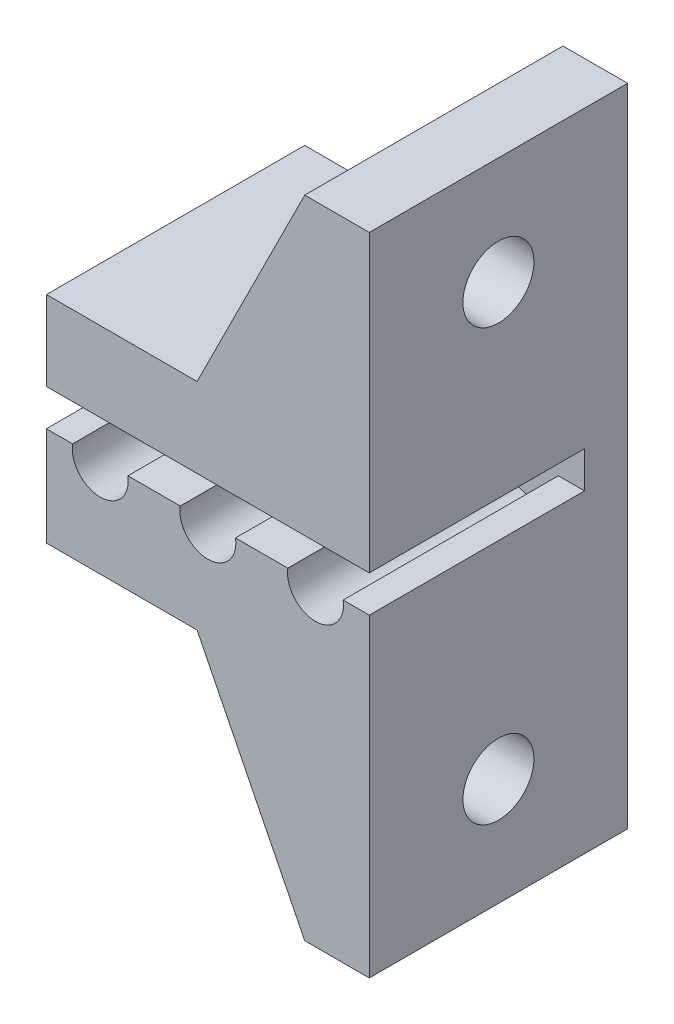
ISO-10303-21;
HEADER;
FILE_DESCRIPTION(('STEP AP214'),'2;1');
FILE_NAME('part.step','',(''),(''),'','','');
FILE_SCHEMA(('AUTOMOTIVE_DESIGN { 1 0 10303 214 1 1 1 1 }'));
ENDSEC;
DATA;
#1=APPLICATION_CONTEXT('core data for automotive mechanical design processes');
#2=APPLICATION_PROTOCOL_DEFINITION('international standard','automotive_design',2000,#1);
#3=PRODUCT_CONTEXT('',#1,'mechanical');
#4=PRODUCT('Part','Part','',(#3));
#5=PRODUCT_RELATED_PRODUCT_CATEGORY('part','',(#4));
#6=PRODUCT_DEFINITION_FORMATION('','',#4);
#7=PRODUCT_DEFINITION_CONTEXT('part definition',#1,'design');
#8=PRODUCT_DEFINITION('design','',#6,#7);
#9=PRODUCT_DEFINITION_SHAPE('','',#8);
#10=(LENGTH_UNIT() NAMED_UNIT(*) SI_UNIT(.MILLI.,.METRE.));
#11=(NAMED_UNIT(*) PLANE_ANGLE_UNIT() SI_UNIT($,.RADIAN.));
#12=(NAMED_UNIT(*) SI_UNIT($,.STERADIAN.) SOLID_ANGLE_UNIT());
#13=UNCERTAINTY_MEASURE_WITH_UNIT(LENGTH_MEASURE(1.E-05),#10,'distance_accuracy_value','');
#14=(GEOMETRIC_REPRESENTATION_CONTEXT(3) GLOBAL_UNCERTAINTY_ASSIGNED_CONTEXT((#13)) GLOBAL_UNIT_ASSIGNED_CONTEXT((#10,
#11,#12)) REPRESENTATION_CONTEXT('',''));
#15=CARTESIAN_POINT('',(0.,0.,0.));
#16=DIRECTION('',(0.,0.,1.));
#17=DIRECTION('',(1.,0.,0.));
#18=AXIS2_PLACEMENT_3D('',#15,#16,#17);
#19=CARTESIAN_POINT('',(12.,0.,10.));
#20=DIRECTION('',(1.,0.,0.));
#21=DIRECTION('',(0.,1.,0.));
#22=AXIS2_PLACEMENT_3D('',#19,#20,#21);
#23=PLANE('',#22);
#24=CARTESIAN_POINT('',(12.,-10.,4.));
#25=DIRECTION('',(1.,0.,0.));
#26=DIRECTION('',(0.,1.,0.));
#27=AXIS2_PLACEMENT_3D('',#24,#25,#26);
#28=CIRCLE('',#27,1.65);
#29=CARTESIAN_POINT('',(12.,-8.35,4.));
#30=VERTEX_POINT('',#29);
#31=EDGE_CURVE('E240',#30,#30,#28,.T.);
#32=ORIENTED_EDGE('',*,*,#31,.T.);
#33=EDGE_LOOP('',(#32));
#34=FACE_BOUND('',#33,.T.);
#35=DIRECTION('',(0.,-1.,0.));
#36=VECTOR('',#35,1.);
#37=CARTESIAN_POINT('',(12.,0.,8.5));
#38=LINE('',#37,#36);
#39=CARTESIAN_POINT('',(12.,-5.,8.5));
#40=VERTEX_POINT('',#39);
#41=CARTESIAN_POINT('',(12.,-15.,8.5));
#42=VERTEX_POINT('',#41);
#43=EDGE_CURVE('E219',#40,#42,#38,.T.);
#44=ORIENTED_EDGE('',*,*,#43,.F.);
#45=DIRECTION('',(0.,0.,-1.));
#46=VECTOR('',#45,1.);
#47=CARTESIAN_POINT('',(12.,-5.,10.));
#48=LINE('',#47,#46);
#49=CARTESIAN_POINT('',(12.,-5.,-0.5));
#50=VERTEX_POINT('',#49);
#51=EDGE_CURVE('E64',#40,#50,#48,.T.);
#52=ORIENTED_EDGE('',*,*,#51,.T.);
#53=DIRECTION('',(0.,1.,0.));
#54=VECTOR('',#53,1.);
#55=CARTESIAN_POINT('',(12.,0.,-0.5));
#56=LINE('',#55,#54);
#57=CARTESIAN_POINT('',(12.,-15.,-0.5));
#58=VERTEX_POINT('',#57);
#59=EDGE_CURVE('E228',#58,#50,#56,.T.);
#60=ORIENTED_EDGE('',*,*,#59,.F.);
#61=DIRECTION('',(0.,0.,-1.));
#62=VECTOR('',#61,1.);
#63=CARTESIAN_POINT('',(12.,-15.,10.));
#64=LINE('',#63,#62);
#65=EDGE_CURVE('E398',#42,#58,#64,.T.);
#66=ORIENTED_EDGE('',*,*,#65,.F.);
#67=EDGE_LOOP('',(#44,#52,#60,#66));
#68=FACE_BOUND('',#67,.T.);
#69=ADVANCED_FACE('F41',(#34,#68),#23,.F.);
#70=CARTESIAN_POINT('',(12.,0.,-2.));
#71=DIRECTION('',(-1.,0.,0.));
#72=DIRECTION('',(0.,-1.,0.));
#73=AXIS2_PLACEMENT_3D('',#70,#71,#72);
#74=PLANE('',#73);
#75=CARTESIAN_POINT('',(12.,10.,4.));
#76=DIRECTION('',(-1.,0.,0.));
#77=DIRECTION('',(0.,-1.,0.));
#78=AXIS2_PLACEMENT_3D('',#75,#76,#77);
#79=CIRCLE('',#78,1.65);
#80=CARTESIAN_POINT('',(12.,8.35,4.));
#81=VERTEX_POINT('',#80);
#82=EDGE_CURVE('E275',#81,#81,#79,.T.);
#83=ORIENTED_EDGE('',*,*,#82,.F.);
#84=EDGE_LOOP('',(#83));
#85=FACE_BOUND('',#84,.T.);
#86=DIRECTION('',(0.,0.,1.));
#87=VECTOR('',#86,1.);
#88=CARTESIAN_POINT('',(12.,15.,-2.));
#89=LINE('',#88,#87);
#90=CARTESIAN_POINT('',(12.,15.,-0.5));
#91=VERTEX_POINT('',#90);
#92=CARTESIAN_POINT('',(12.,15.,8.5));
#93=VERTEX_POINT('',#92);
#94=EDGE_CURVE('E332',#91,#93,#89,.T.);
#95=ORIENTED_EDGE('',*,*,#94,.F.);
#96=DIRECTION('',(0.,-1.,0.));
#97=VECTOR('',#96,1.);
#98=CARTESIAN_POINT('',(12.,0.,-0.5));
#99=LINE('',#98,#97);
#100=CARTESIAN_POINT('',(12.,5.,-0.5));
#101=VERTEX_POINT('',#100);
#102=EDGE_CURVE('E254',#91,#101,#99,.T.);
#103=ORIENTED_EDGE('',*,*,#102,.T.);
#104=DIRECTION('',(0.,0.,1.));
#105=VECTOR('',#104,1.);
#106=CARTESIAN_POINT('',(12.,5.,-2.));
#107=LINE('',#106,#105);
#108=CARTESIAN_POINT('',(12.,5.,8.5));
#109=VERTEX_POINT('',#108);
#110=EDGE_CURVE('E327',#101,#109,#107,.T.);
#111=ORIENTED_EDGE('',*,*,#110,.T.);
#112=DIRECTION('',(0.,1.,0.));
#113=VECTOR('',#112,1.);
#114=CARTESIAN_POINT('',(12.,0.,8.5));
#115=LINE('',#114,#113);
#116=EDGE_CURVE('E269',#109,#93,#115,.T.);
#117=ORIENTED_EDGE('',*,*,#116,.T.);
#118=EDGE_LOOP('',(#95,#103,#111,#117));
#119=FACE_BOUND('',#118,.T.);
#120=ADVANCED_FACE('F436',(#85,#119),#74,.T.);
#121=CARTESIAN_POINT('',(0.,0.,0.));
#122=DIRECTION('',(0.,0.,1.));
#123=DIRECTION('',(1.,0.,0.));
#124=AXIS2_PLACEMENT_3D('',#121,#122,#123);
#125=PLANE('',#124);
#126=DIRECTION('',(0.,1.,0.));
#127=VECTOR('',#126,1.);
#128=CARTESIAN_POINT('',(15.,0.,0.));
#129=LINE('',#128,#127);
#130=CARTESIAN_POINT('',(15.,-0.4,0.));
#131=VERTEX_POINT('',#130);
#132=CARTESIAN_POINT('',(15.,1.3,0.));
#133=VERTEX_POINT('',#132);
#134=EDGE_CURVE('E302',#131,#133,#129,.T.);
#135=ORIENTED_EDGE('',*,*,#134,.T.);
#136=DIRECTION('',(1.,0.,0.));
#137=VECTOR('',#136,1.);
#138=CARTESIAN_POINT('',(0.,1.3,0.));
#139=LINE('',#138,#137);
#140=CARTESIAN_POINT('',(0.,1.3,0.));
#141=VERTEX_POINT('',#140);
#142=EDGE_CURVE('E281',#141,#133,#139,.T.);
#143=ORIENTED_EDGE('',*,*,#142,.F.);
#144=DIRECTION('',(0.,-1.,0.));
#145=VECTOR('',#144,1.);
#146=CARTESIAN_POINT('',(0.,0.,0.));
#147=LINE('',#146,#145);
#148=CARTESIAN_POINT('',(0.,-0.4,0.));
#149=VERTEX_POINT('',#148);
#150=EDGE_CURVE('E307',#141,#149,#147,.T.);
#151=ORIENTED_EDGE('',*,*,#150,.T.);
#152=DIRECTION('',(1.,0.,0.));
#153=VECTOR('',#152,1.);
#154=CARTESIAN_POINT('',(0.,-0.4,0.));
#155=LINE('',#154,#153);
#156=CARTESIAN_POINT('',(1.21547674213349,-0.4,0.));
#157=VERTEX_POINT('',#156);
#158=EDGE_CURVE('E326',#149,#157,#155,.T.);
#159=ORIENTED_EDGE('',*,*,#158,.T.);
#160=CARTESIAN_POINT('',(2.5,-0.6,0.));
#161=DIRECTION('',(0.,0.,1.));
#162=DIRECTION('',(1.,0.,0.));
#163=AXIS2_PLACEMENT_3D('',#160,#161,#162);
#164=CIRCLE('',#163,1.3);
#165=CARTESIAN_POINT('',(3.78452325786651,-0.4,0.));
#166=VERTEX_POINT('',#165);
#167=EDGE_CURVE('E338',#157,#166,#164,.T.);
#168=ORIENTED_EDGE('',*,*,#167,.T.);
#169=DIRECTION('',(1.,0.,0.));
#170=VECTOR('',#169,1.);
#171=CARTESIAN_POINT('',(0.,-0.400000000000001,0.));
#172=LINE('',#171,#170);
#173=CARTESIAN_POINT('',(6.21547674213349,-0.4,0.));
#174=VERTEX_POINT('',#173);
#175=EDGE_CURVE('E378',#166,#174,#172,.T.);
#176=ORIENTED_EDGE('',*,*,#175,.T.);
#177=CARTESIAN_POINT('',(7.5,-0.6,0.));
#178=DIRECTION('',(0.,0.,1.));
#179=DIRECTION('',(1.,0.,0.));
#180=AXIS2_PLACEMENT_3D('',#177,#178,#179);
#181=CIRCLE('',#180,1.3);
#182=CARTESIAN_POINT('',(8.78452325786651,-0.4,0.));
#183=VERTEX_POINT('',#182);
#184=EDGE_CURVE('E375',#174,#183,#181,.T.);
#185=ORIENTED_EDGE('',*,*,#184,.T.);
#186=DIRECTION('',(1.,0.,0.));
#187=VECTOR('',#186,1.);
#188=CARTESIAN_POINT('',(0.,-0.400000000000001,0.));
#189=LINE('',#188,#187);
#190=CARTESIAN_POINT('',(11.2154767421335,-0.4,0.));
#191=VERTEX_POINT('',#190);
#192=EDGE_CURVE('E372',#183,#191,#189,.T.);
#193=ORIENTED_EDGE('',*,*,#192,.T.);
#194=CARTESIAN_POINT('',(12.5,-0.6,0.));
#195=DIRECTION('',(0.,0.,1.));
#196=DIRECTION('',(1.,0.,0.));
#197=AXIS2_PLACEMENT_3D('',#194,#195,#196);
#198=CIRCLE('',#197,1.3);
#199=CARTESIAN_POINT('',(13.7845232578665,-0.4,0.));
#200=VERTEX_POINT('',#199);
#201=EDGE_CURVE('E369',#191,#200,#198,.T.);
#202=ORIENTED_EDGE('',*,*,#201,.T.);
#203=DIRECTION('',(1.,0.,0.));
#204=VECTOR('',#203,1.);
#205=CARTESIAN_POINT('',(0.,-0.400000000000003,0.));
#206=LINE('',#205,#204);
#207=EDGE_CURVE('E366',#200,#131,#206,.T.);
#208=ORIENTED_EDGE('',*,*,#207,.T.);
#209=EDGE_LOOP('',(#135,#143,#151,#159,#168,#176,#185,#193,#202,#208));
#210=FACE_BOUND('',#209,.T.);
#211=ADVANCED_FACE('F474',(#210),#125,.T.);
#212=CARTESIAN_POINT('',(0.,-0.4,10.));
#213=DIRECTION('',(0.,1.,0.));
#214=DIRECTION('',(-1.,0.,0.));
#215=AXIS2_PLACEMENT_3D('',#212,#213,#214);
#216=PLANE('',#215);
#217=ORIENTED_EDGE('',*,*,#158,.F.);
#218=DIRECTION('',(0.,0.,-1.));
#219=VECTOR('',#218,1.);
#220=CARTESIAN_POINT('',(0.,-0.4,10.));
#221=LINE('',#220,#219);
#222=CARTESIAN_POINT('',(0.,-0.4,10.));
#223=VERTEX_POINT('',#222);
#224=EDGE_CURVE('E11',#223,#149,#221,.T.);
#225=ORIENTED_EDGE('',*,*,#224,.F.);
#226=DIRECTION('',(1.,0.,0.));
#227=VECTOR('',#226,1.);
#228=CARTESIAN_POINT('',(0.,-0.4,10.));
#229=LINE('',#228,#227);
#230=CARTESIAN_POINT('',(1.21547674213349,-0.4,10.));
#231=VERTEX_POINT('',#230);
#232=EDGE_CURVE('E334',#223,#231,#229,.T.);
#233=ORIENTED_EDGE('',*,*,#232,.T.);
#234=DIRECTION('',(0.,0.,-1.));
#235=VECTOR('',#234,1.);
#236=CARTESIAN_POINT('',(1.21547674213349,-0.4,10.));
#237=LINE('',#236,#235);
#238=EDGE_CURVE('E363',#231,#157,#237,.T.);
#239=ORIENTED_EDGE('',*,*,#238,.T.);
#240=EDGE_LOOP('',(#217,#225,#233,#239));
#241=FACE_BOUND('',#240,.T.);
#242=ADVANCED_FACE('F43',(#241),#216,.T.);
#243=CARTESIAN_POINT('',(0.,0.,10.));
#244=DIRECTION('',(1.,0.,0.));
#245=DIRECTION('',(0.,0.,-1.));
#246=AXIS2_PLACEMENT_3D('',#243,#244,#245);
#247=PLANE('',#246);
#248=ORIENTED_EDGE('',*,*,#224,.T.);
#249=ORIENTED_EDGE('',*,*,#150,.F.);
#250=DIRECTION('',(0.,0.,-1.));
#251=VECTOR('',#250,1.);
#252=CARTESIAN_POINT('',(0.,1.3,10.));
#253=LINE('',#252,#251);
#254=CARTESIAN_POINT('',(0.,1.3,10.));
#255=VERTEX_POINT('',#254);
#256=EDGE_CURVE('E299',#255,#141,#253,.T.);
#257=ORIENTED_EDGE('',*,*,#256,.F.);
#258=DIRECTION('',(0.,-1.,0.));
#259=VECTOR('',#258,1.);
#260=CARTESIAN_POINT('',(0.,0.,10.));
#261=LINE('',#260,#259);
#262=CARTESIAN_POINT('',(0.,5.,10.));
#263=VERTEX_POINT('',#262);
#264=EDGE_CURVE('E282',#263,#255,#261,.T.);
#265=ORIENTED_EDGE('',*,*,#264,.F.);
#266=DIRECTION('',(0.,0.,1.));
#267=VECTOR('',#266,1.);
#268=CARTESIAN_POINT('',(0.,5.,-2.));
#269=LINE('',#268,#267);
#270=CARTESIAN_POINT('',(0.,5.,-2.));
#271=VERTEX_POINT('',#270);
#272=EDGE_CURVE('E323',#271,#263,#269,.T.);
#273=ORIENTED_EDGE('',*,*,#272,.F.);
#274=DIRECTION('',(0.,-1.,0.));
#275=VECTOR('',#274,1.);
#276=CARTESIAN_POINT('',(0.,0.,-2.));
#277=LINE('',#276,#275);
#278=CARTESIAN_POINT('',(0.,-5.,-2.));
#279=VERTEX_POINT('',#278);
#280=EDGE_CURVE('E314',#271,#279,#277,.T.);
#281=ORIENTED_EDGE('',*,*,#280,.T.);
#282=DIRECTION('',(0.,0.,-1.));
#283=VECTOR('',#282,1.);
#284=CARTESIAN_POINT('',(0.,-5.,10.));
#285=LINE('',#284,#283);
#286=CARTESIAN_POINT('',(0.,-5.,10.));
#287=VERTEX_POINT('',#286);
#288=EDGE_CURVE('E49',#287,#279,#285,.T.);
#289=ORIENTED_EDGE('',*,*,#288,.F.);
#290=DIRECTION('',(0.,-1.,0.));
#291=VECTOR('',#290,1.);
#292=CARTESIAN_POINT('',(0.,0.,10.));
#293=LINE('',#292,#291);
#294=EDGE_CURVE('E337',#223,#287,#293,.T.);
#295=ORIENTED_EDGE('',*,*,#294,.F.);
#296=EDGE_LOOP('',(#248,#249,#257,#265,#273,#281,#289,#295));
#297=FACE_BOUND('',#296,.T.);
#298=ADVANCED_FACE('F413',(#297),#247,.F.);
#299=CARTESIAN_POINT('',(0.,-5.,10.));
#300=DIRECTION('',(0.,1.,0.));
#301=DIRECTION('',(-1.,0.,0.));
#302=AXIS2_PLACEMENT_3D('',#299,#300,#301);
#303=PLANE('',#302);
#304=DIRECTION('',(1.,0.,0.));
#305=VECTOR('',#304,1.);
#306=CARTESIAN_POINT('',(0.,-5.,8.5));
#307=LINE('',#306,#305);
#308=CARTESIAN_POINT('',(7.,-5.,8.5));
#309=VERTEX_POINT('',#308);
#310=EDGE_CURVE('E215',#309,#40,#307,.T.);
#311=ORIENTED_EDGE('',*,*,#310,.F.);
#312=DIRECTION('',(0.,0.,1.));
#313=VECTOR('',#312,1.);
#314=CARTESIAN_POINT('',(7.,-5.,10.));
#315=LINE('',#314,#313);
#316=CARTESIAN_POINT('',(7.,-5.,10.));
#317=VERTEX_POINT('',#316);
#318=EDGE_CURVE('E204',#309,#317,#315,.T.);
#319=ORIENTED_EDGE('',*,*,#318,.T.);
#320=DIRECTION('',(1.,0.,0.));
#321=VECTOR('',#320,1.);
#322=CARTESIAN_POINT('',(0.,-5.,10.));
#323=LINE('',#322,#321);
#324=EDGE_CURVE('E340',#287,#317,#323,.T.);
#325=ORIENTED_EDGE('',*,*,#324,.F.);
#326=ORIENTED_EDGE('',*,*,#288,.T.);
#327=DIRECTION('',(1.,0.,0.));
#328=VECTOR('',#327,1.);
#329=CARTESIAN_POINT('',(0.,-5.,-2.));
#330=LINE('',#329,#328);
#331=CARTESIAN_POINT('',(7.,-5.,-2.));
#332=VERTEX_POINT('',#331);
#333=EDGE_CURVE('E317',#279,#332,#330,.T.);
#334=ORIENTED_EDGE('',*,*,#333,.T.);
#335=DIRECTION('',(0.,0.,-1.));
#336=VECTOR('',#335,1.);
#337=CARTESIAN_POINT('',(7.,-5.,10.));
#338=LINE('',#337,#336);
#339=CARTESIAN_POINT('',(7.,-5.,-0.5));
#340=VERTEX_POINT('',#339);
#341=EDGE_CURVE('E56',#332,#340,#338,.F.);
#342=ORIENTED_EDGE('',*,*,#341,.T.);
#343=DIRECTION('',(-1.,0.,0.));
#344=VECTOR('',#343,1.);
#345=CARTESIAN_POINT('',(0.,-5.,-0.5));
#346=LINE('',#345,#344);
#347=EDGE_CURVE('E233',#50,#340,#346,.T.);
#348=ORIENTED_EDGE('',*,*,#347,.F.);
#349=ORIENTED_EDGE('',*,*,#51,.F.);
#350=EDGE_LOOP('',(#311,#319,#325,#326,#334,#342,#348,#349));
#351=FACE_BOUND('',#350,.T.);
#352=ADVANCED_FACE('F221',(#351),#303,.F.);
#353=CARTESIAN_POINT('',(0.,-15.,10.));
#354=DIRECTION('',(0.,1.,0.));
#355=DIRECTION('',(0.,0.,1.));
#356=AXIS2_PLACEMENT_3D('',#353,#354,#355);
#357=PLANE('',#356);
#358=CARTESIAN_POINT('',(12.,-15.,10.));
#359=VERTEX_POINT('',#358);
#360=EDGE_CURVE('E399',#359,#42,#64,.T.);
#361=ORIENTED_EDGE('',*,*,#360,.T.);
#362=ORIENTED_EDGE('',*,*,#65,.T.);
#363=DIRECTION('',(0.,0.,-1.));
#364=VECTOR('',#363,1.);
#365=CARTESIAN_POINT('',(12.,-15.,10.));
#366=LINE('',#365,#364);
#367=CARTESIAN_POINT('',(12.,-15.,-2.));
#368=VERTEX_POINT('',#367);
#369=EDGE_CURVE('E235',#368,#58,#366,.F.);
#370=ORIENTED_EDGE('',*,*,#369,.F.);
#371=DIRECTION('',(1.,0.,0.));
#372=VECTOR('',#371,1.);
#373=CARTESIAN_POINT('',(0.,-15.,-2.));
#374=LINE('',#373,#372);
#375=CARTESIAN_POINT('',(15.,-15.,-2.));
#376=VERTEX_POINT('',#375);
#377=EDGE_CURVE('E303',#368,#376,#374,.T.);
#378=ORIENTED_EDGE('',*,*,#377,.T.);
#379=DIRECTION('',(0.,0.,-1.));
#380=VECTOR('',#379,1.);
#381=CARTESIAN_POINT('',(15.,-15.,10.));
#382=LINE('',#381,#380);
#383=CARTESIAN_POINT('',(15.,-15.,10.));
#384=VERTEX_POINT('',#383);
#385=EDGE_CURVE('E396',#384,#376,#382,.T.);
#386=ORIENTED_EDGE('',*,*,#385,.F.);
#387=DIRECTION('',(1.,0.,0.));
#388=VECTOR('',#387,1.);
#389=CARTESIAN_POINT('',(0.,-15.,10.));
#390=LINE('',#389,#388);
#391=EDGE_CURVE('E342',#359,#384,#390,.T.);
#392=ORIENTED_EDGE('',*,*,#391,.F.);
#393=EDGE_LOOP('',(#361,#362,#370,#378,#386,#392));
#394=FACE_BOUND('',#393,.T.);
#395=ADVANCED_FACE('F454',(#394),#357,.F.);
#396=CARTESIAN_POINT('',(15.,0.,10.));
#397=DIRECTION('',(-1.,0.,0.));
#398=DIRECTION('',(0.,-1.,0.));
#399=AXIS2_PLACEMENT_3D('',#396,#397,#398);
#400=PLANE('',#399);
#401=DIRECTION('',(0.,0.,-1.));
#402=VECTOR('',#401,1.);
#403=CARTESIAN_POINT('',(15.,1.3,10.));
#404=LINE('',#403,#402);
#405=CARTESIAN_POINT('',(15.,1.3,10.));
#406=VERTEX_POINT('',#405);
#407=EDGE_CURVE('E295',#406,#133,#404,.T.);
#408=ORIENTED_EDGE('',*,*,#407,.T.);
#409=ORIENTED_EDGE('',*,*,#134,.F.);
#410=DIRECTION('',(0.,0.,-1.));
#411=VECTOR('',#410,1.);
#412=CARTESIAN_POINT('',(15.,-0.4,10.));
#413=LINE('',#412,#411);
#414=CARTESIAN_POINT('',(15.,-0.4,10.));
#415=VERTEX_POINT('',#414);
#416=EDGE_CURVE('E394',#415,#131,#413,.T.);
#417=ORIENTED_EDGE('',*,*,#416,.F.);
#418=DIRECTION('',(0.,1.,0.));
#419=VECTOR('',#418,1.);
#420=CARTESIAN_POINT('',(15.,0.,10.));
#421=LINE('',#420,#419);
#422=EDGE_CURVE('E344',#384,#415,#421,.T.);
#423=ORIENTED_EDGE('',*,*,#422,.F.);
#424=ORIENTED_EDGE('',*,*,#385,.T.);
#425=DIRECTION('',(0.,1.,0.));
#426=VECTOR('',#425,1.);
#427=CARTESIAN_POINT('',(15.,0.,-2.));
#428=LINE('',#427,#426);
#429=CARTESIAN_POINT('',(15.,15.,-2.));
#430=VERTEX_POINT('',#429);
#431=EDGE_CURVE('E306',#376,#430,#428,.T.);
#432=ORIENTED_EDGE('',*,*,#431,.T.);
#433=DIRECTION('',(0.,0.,1.));
#434=VECTOR('',#433,1.);
#435=CARTESIAN_POINT('',(15.,15.,-2.));
#436=LINE('',#435,#434);
#437=CARTESIAN_POINT('',(15.,15.,10.));
#438=VERTEX_POINT('',#437);
#439=EDGE_CURVE('E319',#430,#438,#436,.T.);
#440=ORIENTED_EDGE('',*,*,#439,.T.);
#441=DIRECTION('',(0.,1.,0.));
#442=VECTOR('',#441,1.);
#443=CARTESIAN_POINT('',(15.,0.,10.));
#444=LINE('',#443,#442);
#445=EDGE_CURVE('E287',#406,#438,#444,.T.);
#446=ORIENTED_EDGE('',*,*,#445,.F.);
#447=EDGE_LOOP('',(#408,#409,#417,#423,#424,#432,#440,#446));
#448=FACE_BOUND('',#447,.T.);
#449=CARTESIAN_POINT('',(15.,10.,4.));
#450=DIRECTION('',(-1.,0.,0.));
#451=DIRECTION('',(0.,-1.,0.));
#452=AXIS2_PLACEMENT_3D('',#449,#450,#451);
#453=CIRCLE('',#452,1.65);
#454=CARTESIAN_POINT('',(15.,8.35,4.));
#455=VERTEX_POINT('',#454);
#456=EDGE_CURVE('E278',#455,#455,#453,.F.);
#457=ORIENTED_EDGE('',*,*,#456,.F.);
#458=EDGE_LOOP('',(#457));
#459=FACE_BOUND('',#458,.T.);
#460=CARTESIAN_POINT('',(15.,-10.,4.));
#461=DIRECTION('',(-1.,0.,0.));
#462=DIRECTION('',(0.,-1.,0.));
#463=AXIS2_PLACEMENT_3D('',#460,#461,#462);
#464=CIRCLE('',#463,1.65);
#465=CARTESIAN_POINT('',(15.,-11.65,4.));
#466=VERTEX_POINT('',#465);
#467=EDGE_CURVE('E239',#466,#466,#464,.T.);
#468=ORIENTED_EDGE('',*,*,#467,.T.);
#469=EDGE_LOOP('',(#468));
#470=FACE_BOUND('',#469,.T.);
#471=ADVANCED_FACE('F448',(#448,#459,#470),#400,.F.);
#472=CARTESIAN_POINT('',(0.,-0.400000000000003,10.));
#473=DIRECTION('',(0.,1.,0.));
#474=DIRECTION('',(-1.,0.,0.));
#475=AXIS2_PLACEMENT_3D('',#472,#473,#474);
#476=PLANE('',#475);
#477=ORIENTED_EDGE('',*,*,#416,.T.);
#478=ORIENTED_EDGE('',*,*,#207,.F.);
#479=DIRECTION('',(0.,0.,-1.));
#480=VECTOR('',#479,1.);
#481=CARTESIAN_POINT('',(13.7845232578665,-0.4,10.));
#482=LINE('',#481,#480);
#483=CARTESIAN_POINT('',(13.7845232578665,-0.4,10.));
#484=VERTEX_POINT('',#483);
#485=EDGE_CURVE('E392',#484,#200,#482,.T.);
#486=ORIENTED_EDGE('',*,*,#485,.F.);
#487=DIRECTION('',(1.,0.,0.));
#488=VECTOR('',#487,1.);
#489=CARTESIAN_POINT('',(0.,-0.400000000000003,10.));
#490=LINE('',#489,#488);
#491=EDGE_CURVE('E346',#484,#415,#490,.T.);
#492=ORIENTED_EDGE('',*,*,#491,.T.);
#493=EDGE_LOOP('',(#477,#478,#486,#492));
#494=FACE_BOUND('',#493,.T.);
#495=ADVANCED_FACE('F535',(#494),#476,.T.);
#496=CARTESIAN_POINT('',(12.5,-0.6,10.));
#497=DIRECTION('',(0.,0.,-1.));
#498=DIRECTION('',(-1.,0.,0.));
#499=AXIS2_PLACEMENT_3D('',#496,#497,#498);
#500=CYLINDRICAL_SURFACE('',#499,1.3);
#501=ORIENTED_EDGE('',*,*,#485,.T.);
#502=ORIENTED_EDGE('',*,*,#201,.F.);
#503=DIRECTION('',(0.,0.,-1.));
#504=VECTOR('',#503,1.);
#505=CARTESIAN_POINT('',(11.2154767421335,-0.4,10.));
#506=LINE('',#505,#504);
#507=CARTESIAN_POINT('',(11.2154767421335,-0.4,10.));
#508=VERTEX_POINT('',#507);
#509=EDGE_CURVE('E390',#508,#191,#506,.T.);
#510=ORIENTED_EDGE('',*,*,#509,.F.);
#511=CARTESIAN_POINT('',(12.5,-0.6,10.));
#512=DIRECTION('',(0.,0.,1.));
#513=DIRECTION('',(1.,0.,0.));
#514=AXIS2_PLACEMENT_3D('',#511,#512,#513);
#515=CIRCLE('',#514,1.3);
#516=EDGE_CURVE('E349',#508,#484,#515,.T.);
#517=ORIENTED_EDGE('',*,*,#516,.T.);
#518=EDGE_LOOP('',(#501,#502,#510,#517));
#519=FACE_BOUND('',#518,.T.);
#520=ADVANCED_FACE('F531',(#519),#500,.F.);
#521=CARTESIAN_POINT('',(0.,-0.400000000000001,10.));
#522=DIRECTION('',(0.,1.,0.));
#523=DIRECTION('',(-1.,0.,0.));
#524=AXIS2_PLACEMENT_3D('',#521,#522,#523);
#525=PLANE('',#524);
#526=ORIENTED_EDGE('',*,*,#509,.T.);
#527=ORIENTED_EDGE('',*,*,#192,.F.);
#528=DIRECTION('',(0.,0.,-1.));
#529=VECTOR('',#528,1.);
#530=CARTESIAN_POINT('',(8.78452325786651,-0.4,10.));
#531=LINE('',#530,#529);
#532=CARTESIAN_POINT('',(8.78452325786651,-0.4,10.));
#533=VERTEX_POINT('',#532);
#534=EDGE_CURVE('E388',#533,#183,#531,.T.);
#535=ORIENTED_EDGE('',*,*,#534,.F.);
#536=DIRECTION('',(1.,0.,0.));
#537=VECTOR('',#536,1.);
#538=CARTESIAN_POINT('',(0.,-0.400000000000001,10.));
#539=LINE('',#538,#537);
#540=EDGE_CURVE('E352',#533,#508,#539,.T.);
#541=ORIENTED_EDGE('',*,*,#540,.T.);
#542=EDGE_LOOP('',(#526,#527,#535,#541));
#543=FACE_BOUND('',#542,.T.);
#544=ADVANCED_FACE('F527',(#543),#525,.T.);
#545=CARTESIAN_POINT('',(7.5,-0.6,10.));
#546=DIRECTION('',(0.,0.,-1.));
#547=DIRECTION('',(-1.,0.,0.));
#548=AXIS2_PLACEMENT_3D('',#545,#546,#547);
#549=CYLINDRICAL_SURFACE('',#548,1.3);
#550=ORIENTED_EDGE('',*,*,#534,.T.);
#551=ORIENTED_EDGE('',*,*,#184,.F.);
#552=DIRECTION('',(0.,0.,-1.));
#553=VECTOR('',#552,1.);
#554=CARTESIAN_POINT('',(6.21547674213349,-0.4,10.));
#555=LINE('',#554,#553);
#556=CARTESIAN_POINT('',(6.21547674213349,-0.4,10.));
#557=VERTEX_POINT('',#556);
#558=EDGE_CURVE('E386',#557,#174,#555,.T.);
#559=ORIENTED_EDGE('',*,*,#558,.F.);
#560=CARTESIAN_POINT('',(7.5,-0.6,10.));
#561=DIRECTION('',(0.,0.,1.));
#562=DIRECTION('',(1.,0.,0.));
#563=AXIS2_PLACEMENT_3D('',#560,#561,#562);
#564=CIRCLE('',#563,1.3);
#565=EDGE_CURVE('E355',#557,#533,#564,.T.);
#566=ORIENTED_EDGE('',*,*,#565,.T.);
#567=EDGE_LOOP('',(#550,#551,#559,#566));
#568=FACE_BOUND('',#567,.T.);
#569=ADVANCED_FACE('F523',(#568),#549,.F.);
#570=CARTESIAN_POINT('',(0.,-0.400000000000001,10.));
#571=DIRECTION('',(0.,1.,0.));
#572=DIRECTION('',(-1.,0.,0.));
#573=AXIS2_PLACEMENT_3D('',#570,#571,#572);
#574=PLANE('',#573);
#575=DIRECTION('',(1.,0.,0.));
#576=VECTOR('',#575,1.);
#577=CARTESIAN_POINT('',(0.,-0.400000000000001,10.));
#578=LINE('',#577,#576);
#579=CARTESIAN_POINT('',(3.78452325786651,-0.4,10.));
#580=VERTEX_POINT('',#579);
#581=EDGE_CURVE('E358',#580,#557,#578,.T.);
#582=ORIENTED_EDGE('',*,*,#581,.T.);
#583=ORIENTED_EDGE('',*,*,#558,.T.);
#584=ORIENTED_EDGE('',*,*,#175,.F.);
#585=DIRECTION('',(0.,0.,-1.));
#586=VECTOR('',#585,1.);
#587=CARTESIAN_POINT('',(3.78452325786651,-0.4,10.));
#588=LINE('',#587,#586);
#589=EDGE_CURVE('E384',#580,#166,#588,.T.);
#590=ORIENTED_EDGE('',*,*,#589,.F.);
#591=EDGE_LOOP('',(#582,#583,#584,#590));
#592=FACE_BOUND('',#591,.T.);
#593=ADVANCED_FACE('F519',(#592),#574,.T.);
#594=CARTESIAN_POINT('',(2.5,-0.6,10.));
#595=DIRECTION('',(0.,0.,-1.));
#596=DIRECTION('',(-1.,0.,0.));
#597=AXIS2_PLACEMENT_3D('',#594,#595,#596);
#598=CYLINDRICAL_SURFACE('',#597,1.3);
#599=ORIENTED_EDGE('',*,*,#167,.F.);
#600=ORIENTED_EDGE('',*,*,#238,.F.);
#601=CARTESIAN_POINT('',(2.5,-0.6,10.));
#602=DIRECTION('',(0.,0.,1.));
#603=DIRECTION('',(1.,0.,0.));
#604=AXIS2_PLACEMENT_3D('',#601,#602,#603);
#605=CIRCLE('',#604,1.3);
#606=EDGE_CURVE('E360',#231,#580,#605,.T.);
#607=ORIENTED_EDGE('',*,*,#606,.T.);
#608=ORIENTED_EDGE('',*,*,#589,.T.);
#609=EDGE_LOOP('',(#599,#600,#607,#608));
#610=FACE_BOUND('',#609,.T.);
#611=ADVANCED_FACE('F517',(#610),#598,.F.);
#612=CARTESIAN_POINT('',(0.,0.,10.));
#613=DIRECTION('',(0.,0.,1.));
#614=DIRECTION('',(1.,0.,0.));
#615=AXIS2_PLACEMENT_3D('',#612,#613,#614);
#616=PLANE('',#615);
#617=ORIENTED_EDGE('',*,*,#324,.T.);
#618=DIRECTION('',(0.447213595499958,-0.894427190999916,0.));
#619=VECTOR('',#618,1.);
#620=CARTESIAN_POINT('',(7.,-5.,10.));
#621=LINE('',#620,#619);
#622=EDGE_CURVE('E210',#317,#359,#621,.T.);
#623=ORIENTED_EDGE('',*,*,#622,.T.);
#624=ORIENTED_EDGE('',*,*,#391,.T.);
#625=ORIENTED_EDGE('',*,*,#422,.T.);
#626=ORIENTED_EDGE('',*,*,#491,.F.);
#627=ORIENTED_EDGE('',*,*,#516,.F.);
#628=ORIENTED_EDGE('',*,*,#540,.F.);
#629=ORIENTED_EDGE('',*,*,#565,.F.);
#630=ORIENTED_EDGE('',*,*,#581,.F.);
#631=ORIENTED_EDGE('',*,*,#606,.F.);
#632=ORIENTED_EDGE('',*,*,#232,.F.);
#633=ORIENTED_EDGE('',*,*,#294,.T.);
#634=EDGE_LOOP('',(#617,#623,#624,#625,#626,#627,#628,#629,#630,#631,#632,#633));
#635=FACE_BOUND('',#634,.T.);
#636=ADVANCED_FACE('F463',(#635),#616,.T.);
#637=CARTESIAN_POINT('',(0.,5.,-2.));
#638=DIRECTION('',(0.,1.,0.));
#639=DIRECTION('',(-1.,0.,0.));
#640=AXIS2_PLACEMENT_3D('',#637,#638,#639);
#641=PLANE('',#640);
#642=ORIENTED_EDGE('',*,*,#272,.T.);
#643=DIRECTION('',(-1.,0.,0.));
#644=VECTOR('',#643,1.);
#645=CARTESIAN_POINT('',(0.,5.,10.));
#646=LINE('',#645,#644);
#647=CARTESIAN_POINT('',(7.,5.,10.));
#648=VERTEX_POINT('',#647);
#649=EDGE_CURVE('E293',#648,#263,#646,.T.);
#650=ORIENTED_EDGE('',*,*,#649,.F.);
#651=DIRECTION('',(0.,0.,-1.));
#652=VECTOR('',#651,1.);
#653=CARTESIAN_POINT('',(7.,5.,-2.));
#654=LINE('',#653,#652);
#655=CARTESIAN_POINT('',(7.,5.,8.5));
#656=VERTEX_POINT('',#655);
#657=EDGE_CURVE('E266',#656,#648,#654,.F.);
#658=ORIENTED_EDGE('',*,*,#657,.F.);
#659=DIRECTION('',(1.,0.,0.));
#660=VECTOR('',#659,1.);
#661=CARTESIAN_POINT('',(0.,5.,8.5));
#662=LINE('',#661,#660);
#663=EDGE_CURVE('E272',#656,#109,#662,.T.);
#664=ORIENTED_EDGE('',*,*,#663,.T.);
#665=ORIENTED_EDGE('',*,*,#110,.F.);
#666=DIRECTION('',(-1.,0.,0.));
#667=VECTOR('',#666,1.);
#668=CARTESIAN_POINT('',(0.,5.,-0.5));
#669=LINE('',#668,#667);
#670=CARTESIAN_POINT('',(7.,5.,-0.5));
#671=VERTEX_POINT('',#670);
#672=EDGE_CURVE('E256',#101,#671,#669,.T.);
#673=ORIENTED_EDGE('',*,*,#672,.T.);
#674=DIRECTION('',(0.,0.,1.));
#675=VECTOR('',#674,1.);
#676=CARTESIAN_POINT('',(7.,5.,-2.));
#677=LINE('',#676,#675);
#678=CARTESIAN_POINT('',(7.,5.,-2.));
#679=VERTEX_POINT('',#678);
#680=EDGE_CURVE('E249',#679,#671,#677,.T.);
#681=ORIENTED_EDGE('',*,*,#680,.F.);
#682=DIRECTION('',(-1.,0.,0.));
#683=VECTOR('',#682,1.);
#684=CARTESIAN_POINT('',(0.,5.,-2.));
#685=LINE('',#684,#683);
#686=EDGE_CURVE('E312',#679,#271,#685,.T.);
#687=ORIENTED_EDGE('',*,*,#686,.T.);
#688=EDGE_LOOP('',(#642,#650,#658,#664,#665,#673,#681,#687));
#689=FACE_BOUND('',#688,.T.);
#690=ADVANCED_FACE('F418',(#689),#641,.T.);
#691=CARTESIAN_POINT('',(0.,15.,-2.));
#692=DIRECTION('',(0.,1.,0.));
#693=DIRECTION('',(-1.,0.,0.));
#694=AXIS2_PLACEMENT_3D('',#691,#692,#693);
#695=PLANE('',#694);
#696=DIRECTION('',(-1.,0.,0.));
#697=VECTOR('',#696,1.);
#698=CARTESIAN_POINT('',(0.,15.,10.));
#699=LINE('',#698,#697);
#700=CARTESIAN_POINT('',(12.,15.,10.));
#701=VERTEX_POINT('',#700);
#702=EDGE_CURVE('E290',#438,#701,#699,.T.);
#703=ORIENTED_EDGE('',*,*,#702,.F.);
#704=ORIENTED_EDGE('',*,*,#439,.F.);
#705=DIRECTION('',(-1.,0.,0.));
#706=VECTOR('',#705,1.);
#707=CARTESIAN_POINT('',(0.,15.,-2.));
#708=LINE('',#707,#706);
#709=CARTESIAN_POINT('',(12.,15.,-2.));
#710=VERTEX_POINT('',#709);
#711=EDGE_CURVE('E310',#430,#710,#708,.T.);
#712=ORIENTED_EDGE('',*,*,#711,.T.);
#713=EDGE_CURVE('E329',#710,#91,#89,.T.);
#714=ORIENTED_EDGE('',*,*,#713,.T.);
#715=ORIENTED_EDGE('',*,*,#94,.T.);
#716=DIRECTION('',(0.,0.,-1.));
#717=VECTOR('',#716,1.);
#718=CARTESIAN_POINT('',(12.,15.,-2.));
#719=LINE('',#718,#717);
#720=EDGE_CURVE('E261',#93,#701,#719,.F.);
#721=ORIENTED_EDGE('',*,*,#720,.T.);
#722=EDGE_LOOP('',(#703,#704,#712,#714,#715,#721));
#723=FACE_BOUND('',#722,.T.);
#724=ADVANCED_FACE('F429',(#723),#695,.T.);
#725=CARTESIAN_POINT('',(0.,0.,-2.));
#726=DIRECTION('',(0.,0.,1.));
#727=DIRECTION('',(1.,0.,0.));
#728=AXIS2_PLACEMENT_3D('',#725,#726,#727);
#729=PLANE('',#728);
#730=ORIENTED_EDGE('',*,*,#280,.F.);
#731=ORIENTED_EDGE('',*,*,#686,.F.);
#732=DIRECTION('',(0.447213595499958,0.894427190999916,0.));
#733=VECTOR('',#732,1.);
#734=CARTESIAN_POINT('',(7.,5.,-2.));
#735=LINE('',#734,#733);
#736=EDGE_CURVE('E246',#679,#710,#735,.T.);
#737=ORIENTED_EDGE('',*,*,#736,.T.);
#738=ORIENTED_EDGE('',*,*,#711,.F.);
#739=ORIENTED_EDGE('',*,*,#431,.F.);
#740=ORIENTED_EDGE('',*,*,#377,.F.);
#741=DIRECTION('',(0.447213595499958,-0.894427190999916,0.));
#742=VECTOR('',#741,1.);
#743=CARTESIAN_POINT('',(7.,-5.,-2.));
#744=LINE('',#743,#742);
#745=EDGE_CURVE('E225',#332,#368,#744,.T.);
#746=ORIENTED_EDGE('',*,*,#745,.F.);
#747=ORIENTED_EDGE('',*,*,#333,.F.);
#748=EDGE_LOOP('',(#730,#731,#737,#738,#739,#740,#746,#747));
#749=FACE_BOUND('',#748,.T.);
#750=ADVANCED_FACE('F409',(#749),#729,.F.);
#751=CARTESIAN_POINT('',(0.,1.3,10.));
#752=DIRECTION('',(0.,1.,0.));
#753=DIRECTION('',(-1.,0.,0.));
#754=AXIS2_PLACEMENT_3D('',#751,#752,#753);
#755=PLANE('',#754);
#756=ORIENTED_EDGE('',*,*,#407,.F.);
#757=DIRECTION('',(1.,0.,0.));
#758=VECTOR('',#757,1.);
#759=CARTESIAN_POINT('',(0.,1.3,10.));
#760=LINE('',#759,#758);
#761=EDGE_CURVE('E285',#255,#406,#760,.T.);
#762=ORIENTED_EDGE('',*,*,#761,.F.);
#763=ORIENTED_EDGE('',*,*,#256,.T.);
#764=ORIENTED_EDGE('',*,*,#142,.T.);
#765=EDGE_LOOP('',(#756,#762,#763,#764));
#766=FACE_BOUND('',#765,.T.);
#767=ADVANCED_FACE('F476',(#766),#755,.F.);
#768=CARTESIAN_POINT('',(0.,0.,10.));
#769=DIRECTION('',(0.,0.,1.));
#770=DIRECTION('',(1.,0.,0.));
#771=AXIS2_PLACEMENT_3D('',#768,#769,#770);
#772=PLANE('',#771);
#773=ORIENTED_EDGE('',*,*,#761,.T.);
#774=ORIENTED_EDGE('',*,*,#445,.T.);
#775=ORIENTED_EDGE('',*,*,#702,.T.);
#776=DIRECTION('',(0.447213595499958,0.894427190999916,0.));
#777=VECTOR('',#776,1.);
#778=CARTESIAN_POINT('',(7.,5.,10.));
#779=LINE('',#778,#777);
#780=EDGE_CURVE('E259',#648,#701,#779,.T.);
#781=ORIENTED_EDGE('',*,*,#780,.F.);
#782=ORIENTED_EDGE('',*,*,#649,.T.);
#783=ORIENTED_EDGE('',*,*,#264,.T.);
#784=EDGE_LOOP('',(#773,#774,#775,#781,#782,#783));
#785=FACE_BOUND('',#784,.T.);
#786=ADVANCED_FACE('F444',(#785),#772,.T.);
#787=CARTESIAN_POINT('',(15.001,10.,4.));
#788=DIRECTION('',(-1.,0.,0.));
#789=DIRECTION('',(0.,-1.,0.));
#790=AXIS2_PLACEMENT_3D('',#787,#788,#789);
#791=CYLINDRICAL_SURFACE('',#790,1.65);
#792=ORIENTED_EDGE('',*,*,#82,.T.);
#793=EDGE_LOOP('',(#792));
#794=FACE_BOUND('',#793,.T.);
#795=ORIENTED_EDGE('',*,*,#456,.T.);
#796=EDGE_LOOP('',(#795));
#797=FACE_BOUND('',#796,.T.);
#798=ADVANCED_FACE('F483',(#794,#797),#791,.F.);
#799=CARTESIAN_POINT('',(7.5,0.,8.5));
#800=DIRECTION('',(0.,0.,1.));
#801=DIRECTION('',(1.,0.,0.));
#802=AXIS2_PLACEMENT_3D('',#799,#800,#801);
#803=PLANE('',#802);
#804=ORIENTED_EDGE('',*,*,#663,.F.);
#805=DIRECTION('',(0.447213595499958,0.894427190999916,0.));
#806=VECTOR('',#805,1.);
#807=CARTESIAN_POINT('',(7.,5.,8.5));
#808=LINE('',#807,#806);
#809=EDGE_CURVE('E258',#656,#93,#808,.T.);
#810=ORIENTED_EDGE('',*,*,#809,.T.);
#811=ORIENTED_EDGE('',*,*,#116,.F.);
#812=EDGE_LOOP('',(#804,#810,#811));
#813=FACE_BOUND('',#812,.T.);
#814=ADVANCED_FACE('F440',(#813),#803,.F.);
#815=CARTESIAN_POINT('',(7.,5.,10.));
#816=DIRECTION('',(0.894427190999916,-0.447213595499958,0.));
#817=DIRECTION('',(0.447213595499958,0.894427190999916,0.));
#818=AXIS2_PLACEMENT_3D('',#815,#816,#817);
#819=PLANE('',#818);
#820=ORIENTED_EDGE('',*,*,#809,.F.);
#821=ORIENTED_EDGE('',*,*,#657,.T.);
#822=ORIENTED_EDGE('',*,*,#780,.T.);
#823=ORIENTED_EDGE('',*,*,#720,.F.);
#824=EDGE_LOOP('',(#820,#821,#822,#823));
#825=FACE_BOUND('',#824,.T.);
#826=ADVANCED_FACE('F442',(#825),#819,.F.);
#827=CARTESIAN_POINT('',(7.,5.,-2.));
#828=DIRECTION('',(-0.894427190999916,0.447213595499958,0.));
#829=DIRECTION('',(0.447213595499958,0.894427190999916,0.));
#830=AXIS2_PLACEMENT_3D('',#827,#828,#829);
#831=PLANE('',#830);
#832=ORIENTED_EDGE('',*,*,#736,.F.);
#833=ORIENTED_EDGE('',*,*,#680,.T.);
#834=DIRECTION('',(0.447213595499958,0.894427190999916,0.));
#835=VECTOR('',#834,1.);
#836=CARTESIAN_POINT('',(7.,5.,-0.5));
#837=LINE('',#836,#835);
#838=EDGE_CURVE('E243',#671,#91,#837,.T.);
#839=ORIENTED_EDGE('',*,*,#838,.T.);
#840=ORIENTED_EDGE('',*,*,#713,.F.);
#841=EDGE_LOOP('',(#832,#833,#839,#840));
#842=FACE_BOUND('',#841,.T.);
#843=ADVANCED_FACE('F424',(#842),#831,.T.);
#844=CARTESIAN_POINT('',(7.5,0.,-0.5));
#845=DIRECTION('',(0.,0.,-1.));
#846=DIRECTION('',(-1.,0.,0.));
#847=AXIS2_PLACEMENT_3D('',#844,#845,#846);
#848=PLANE('',#847);
#849=ORIENTED_EDGE('',*,*,#672,.F.);
#850=ORIENTED_EDGE('',*,*,#102,.F.);
#851=ORIENTED_EDGE('',*,*,#838,.F.);
#852=EDGE_LOOP('',(#849,#850,#851));
#853=FACE_BOUND('',#852,.T.);
#854=ADVANCED_FACE('F433',(#853),#848,.F.);
#855=CARTESIAN_POINT('',(15.001,-10.,4.));
#856=DIRECTION('',(-1.,0.,0.));
#857=DIRECTION('',(0.,-1.,0.));
#858=AXIS2_PLACEMENT_3D('',#855,#856,#857);
#859=CYLINDRICAL_SURFACE('',#858,1.65);
#860=ORIENTED_EDGE('',*,*,#31,.F.);
#861=EDGE_LOOP('',(#860));
#862=FACE_BOUND('',#861,.T.);
#863=ORIENTED_EDGE('',*,*,#467,.F.);
#864=EDGE_LOOP('',(#863));
#865=FACE_BOUND('',#864,.T.);
#866=ADVANCED_FACE('F629',(#862,#865),#859,.F.);
#867=CARTESIAN_POINT('',(7.,-5.,-2.));
#868=DIRECTION('',(0.894427190999916,0.447213595499958,0.));
#869=DIRECTION('',(0.447213595499958,-0.894427190999916,0.));
#870=AXIS2_PLACEMENT_3D('',#867,#868,#869);
#871=PLANE('',#870);
#872=ORIENTED_EDGE('',*,*,#341,.F.);
#873=ORIENTED_EDGE('',*,*,#745,.T.);
#874=ORIENTED_EDGE('',*,*,#369,.T.);
#875=DIRECTION('',(0.447213595499958,-0.894427190999916,0.));
#876=VECTOR('',#875,1.);
#877=CARTESIAN_POINT('',(7.,-5.,-0.5));
#878=LINE('',#877,#876);
#879=EDGE_CURVE('E214',#340,#58,#878,.T.);
#880=ORIENTED_EDGE('',*,*,#879,.F.);
#881=EDGE_LOOP('',(#872,#873,#874,#880));
#882=FACE_BOUND('',#881,.T.);
#883=ADVANCED_FACE('F459',(#882),#871,.F.);
#884=CARTESIAN_POINT('',(7.5,0.,-0.5));
#885=DIRECTION('',(0.,0.,-1.));
#886=DIRECTION('',(-1.,0.,0.));
#887=AXIS2_PLACEMENT_3D('',#884,#885,#886);
#888=PLANE('',#887);
#889=ORIENTED_EDGE('',*,*,#59,.T.);
#890=ORIENTED_EDGE('',*,*,#347,.T.);
#891=ORIENTED_EDGE('',*,*,#879,.T.);
#892=EDGE_LOOP('',(#889,#890,#891));
#893=FACE_BOUND('',#892,.T.);
#894=ADVANCED_FACE('F461',(#893),#888,.F.);
#895=CARTESIAN_POINT('',(7.,-5.,10.));
#896=DIRECTION('',(-0.894427190999916,-0.447213595499958,0.));
#897=DIRECTION('',(0.447213595499958,-0.894427190999916,0.));
#898=AXIS2_PLACEMENT_3D('',#895,#896,#897);
#899=PLANE('',#898);
#900=ORIENTED_EDGE('',*,*,#318,.F.);
#901=DIRECTION('',(0.447213595499958,-0.894427190999916,0.));
#902=VECTOR('',#901,1.);
#903=CARTESIAN_POINT('',(7.,-5.,8.5));
#904=LINE('',#903,#902);
#905=EDGE_CURVE('E208',#309,#42,#904,.T.);
#906=ORIENTED_EDGE('',*,*,#905,.T.);
#907=ORIENTED_EDGE('',*,*,#360,.F.);
#908=ORIENTED_EDGE('',*,*,#622,.F.);
#909=EDGE_LOOP('',(#900,#906,#907,#908));
#910=FACE_BOUND('',#909,.T.);
#911=ADVANCED_FACE('F206',(#910),#899,.T.);
#912=CARTESIAN_POINT('',(7.5,0.,8.5));
#913=DIRECTION('',(0.,0.,1.));
#914=DIRECTION('',(1.,0.,0.));
#915=AXIS2_PLACEMENT_3D('',#912,#913,#914);
#916=PLANE('',#915);
#917=ORIENTED_EDGE('',*,*,#905,.F.);
#918=ORIENTED_EDGE('',*,*,#310,.T.);
#919=ORIENTED_EDGE('',*,*,#43,.T.);
#920=EDGE_LOOP('',(#917,#918,#919));
#921=FACE_BOUND('',#920,.T.);
#922=ADVANCED_FACE('F218',(#921),#916,.F.);
#923=CLOSED_SHELL('',(#69,#120,#211,#242,#298,#352,#395,#471,#495,#520,#544,#569,#593,#611,#636,
#690,#724,#750,#767,#786,#798,#814,#826,#843,#854,#866,#883,#894,#911,#922));
#924=MANIFOLD_SOLID_BREP('B2',#923);
#925=ADVANCED_BREP_SHAPE_REPRESENTATION('',(#18,#924),#14);
#926=SHAPE_DEFINITION_REPRESENTATION(#9,#925);
ENDSEC;
END-ISO-10303-21;
